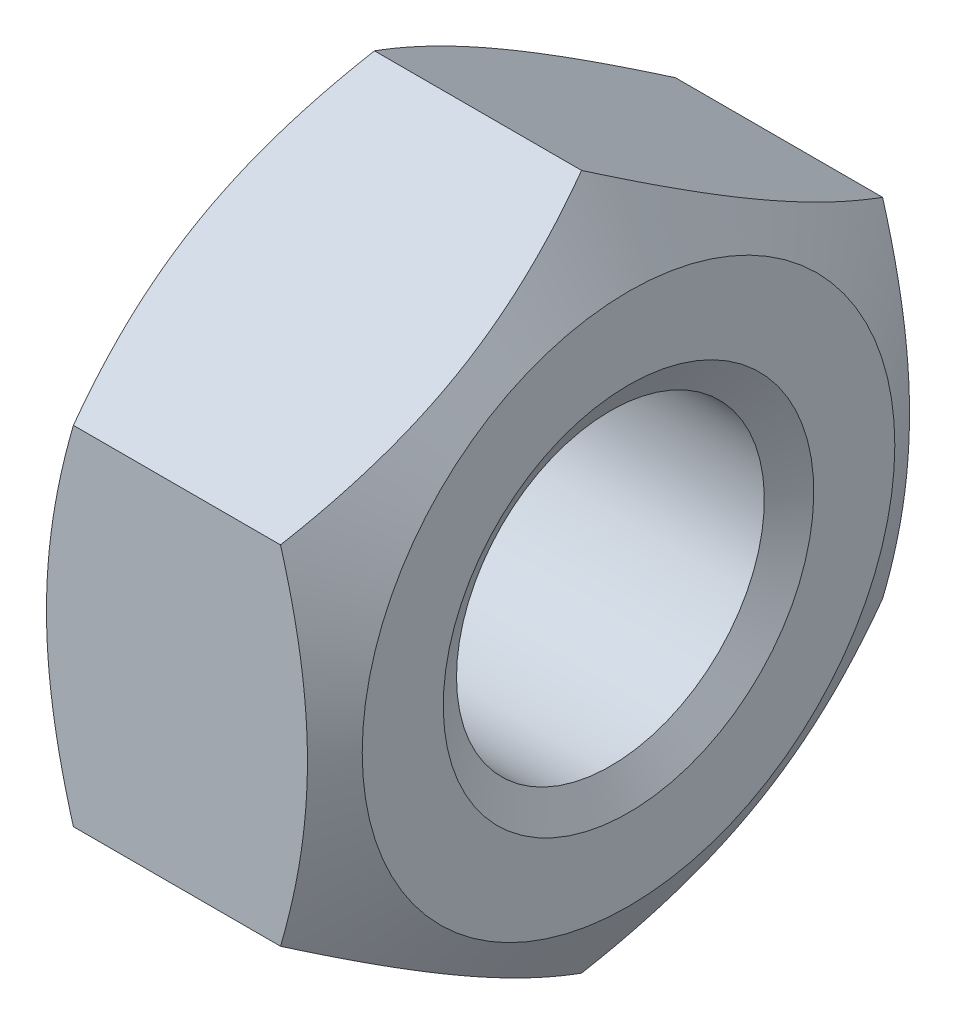
ISO-10303-21;
HEADER;
FILE_DESCRIPTION(('STEP AP214'),'2;1');
FILE_NAME('part.step','',(''),(''),'','','');
FILE_SCHEMA(('AUTOMOTIVE_DESIGN { 1 0 10303 214 1 1 1 1 }'));
ENDSEC;
DATA;
#1=APPLICATION_CONTEXT('core data for automotive mechanical design processes');
#2=APPLICATION_PROTOCOL_DEFINITION('international standard','automotive_design',2000,#1);
#3=PRODUCT_CONTEXT('',#1,'mechanical');
#4=PRODUCT('Part','Part','',(#3));
#5=PRODUCT_RELATED_PRODUCT_CATEGORY('part','',(#4));
#6=PRODUCT_DEFINITION_FORMATION('','',#4);
#7=PRODUCT_DEFINITION_CONTEXT('part definition',#1,'design');
#8=PRODUCT_DEFINITION('design','',#6,#7);
#9=PRODUCT_DEFINITION_SHAPE('','',#8);
#10=(LENGTH_UNIT() NAMED_UNIT(*) SI_UNIT(.MILLI.,.METRE.));
#11=(NAMED_UNIT(*) PLANE_ANGLE_UNIT() SI_UNIT($,.RADIAN.));
#12=(NAMED_UNIT(*) SI_UNIT($,.STERADIAN.) SOLID_ANGLE_UNIT());
#13=UNCERTAINTY_MEASURE_WITH_UNIT(LENGTH_MEASURE(1.E-05),#10,'distance_accuracy_value','');
#14=(GEOMETRIC_REPRESENTATION_CONTEXT(3) GLOBAL_UNCERTAINTY_ASSIGNED_CONTEXT((#13)) GLOBAL_UNIT_ASSIGNED_CONTEXT((#10,
#11,#12)) REPRESENTATION_CONTEXT('',''));
#15=CARTESIAN_POINT('',(0.,0.,0.));
#16=DIRECTION('',(0.,0.,1.));
#17=DIRECTION('',(1.,0.,0.));
#18=AXIS2_PLACEMENT_3D('',#15,#16,#17);
#19=CARTESIAN_POINT('',(0.1953125,0.,0.));
#20=DIRECTION('',(-1.,0.,0.));
#21=DIRECTION('',(0.,0.,1.));
#22=AXIS2_PLACEMENT_3D('',#19,#20,#21);
#23=CONICAL_SURFACE('',#22,3.6617911733533,1.0471975511966);
#24=CARTESIAN_POINT('',(0.390625,0.,0.));
#25=DIRECTION('',(1.,0.,0.));
#26=DIRECTION('',(0.,1.,0.));
#27=AXIS2_PLACEMENT_3D('',#24,#25,#26);
#28=CIRCLE('',#27,3.3235);
#29=CARTESIAN_POINT('',(0.390625,3.3235,0.));
#30=VERTEX_POINT('',#29);
#31=EDGE_CURVE('E10',#30,#30,#28,.T.);
#32=ORIENTED_EDGE('',*,*,#31,.T.);
#33=EDGE_LOOP('',(#32));
#34=FACE_BOUND('',#33,.T.);
#35=CARTESIAN_POINT('',(0.,0.,0.));
#36=DIRECTION('',(-1.,0.,0.));
#37=DIRECTION('',(0.,0.,1.));
#38=AXIS2_PLACEMENT_3D('',#35,#36,#37);
#39=CIRCLE('',#38,4.00008234670659);
#40=CARTESIAN_POINT('',(0.,0.,4.00008234670659));
#41=VERTEX_POINT('',#40);
#42=EDGE_CURVE('E26',#41,#41,#39,.T.);
#43=ORIENTED_EDGE('',*,*,#42,.T.);
#44=EDGE_LOOP('',(#43));
#45=FACE_BOUND('',#44,.T.);
#46=ADVANCED_FACE('F16',(#34,#45),#23,.F.);
#47=CARTESIAN_POINT('',(-14.4384017218762,0.,0.));
#48=DIRECTION('',(1.,0.,0.));
#49=DIRECTION('',(0.,1.,0.));
#50=AXIS2_PLACEMENT_3D('',#47,#48,#49);
#51=CYLINDRICAL_SURFACE('',#50,3.3235);
#52=CARTESIAN_POINT('',(6.109375,0.,0.));
#53=DIRECTION('',(-1.,0.,0.));
#54=DIRECTION('',(0.,0.,1.));
#55=AXIS2_PLACEMENT_3D('',#52,#53,#54);
#56=CIRCLE('',#55,3.3235);
#57=CARTESIAN_POINT('',(6.109375,0.,3.3235));
#58=VERTEX_POINT('',#57);
#59=EDGE_CURVE('E192',#58,#58,#56,.T.);
#60=ORIENTED_EDGE('',*,*,#59,.F.);
#61=EDGE_LOOP('',(#60));
#62=FACE_BOUND('',#61,.T.);
#63=ORIENTED_EDGE('',*,*,#31,.F.);
#64=EDGE_LOOP('',(#63));
#65=FACE_BOUND('',#64,.T.);
#66=ADVANCED_FACE('F205',(#62,#65),#51,.F.);
#67=CARTESIAN_POINT('',(0.,0.,0.));
#68=DIRECTION('',(1.,0.,0.));
#69=DIRECTION('',(0.,0.,-1.));
#70=AXIS2_PLACEMENT_3D('',#67,#68,#69);
#71=PLANE('',#70);
#72=CARTESIAN_POINT('',(0.,0.,0.));
#73=DIRECTION('',(-1.,0.,0.));
#74=DIRECTION('',(0.,0.,1.));
#75=AXIS2_PLACEMENT_3D('',#72,#73,#74);
#76=CIRCLE('',#75,5.75);
#77=CARTESIAN_POINT('',(0.,0.,5.75));
#78=VERTEX_POINT('',#77);
#79=EDGE_CURVE('E193',#78,#78,#76,.T.);
#80=ORIENTED_EDGE('',*,*,#79,.T.);
#81=EDGE_LOOP('',(#80));
#82=FACE_BOUND('',#81,.T.);
#83=ORIENTED_EDGE('',*,*,#42,.F.);
#84=EDGE_LOOP('',(#83));
#85=FACE_BOUND('',#84,.T.);
#86=ADVANCED_FACE('F202',(#82,#85),#71,.F.);
#87=CARTESIAN_POINT('',(6.3046875,0.,0.));
#88=DIRECTION('',(1.,0.,0.));
#89=DIRECTION('',(0.,1.,0.));
#90=AXIS2_PLACEMENT_3D('',#87,#88,#89);
#91=CONICAL_SURFACE('',#90,3.6617911733533,1.0471975511966);
#92=ORIENTED_EDGE('',*,*,#59,.T.);
#93=EDGE_LOOP('',(#92));
#94=FACE_BOUND('',#93,.T.);
#95=CARTESIAN_POINT('',(6.5,0.,0.));
#96=DIRECTION('',(1.,0.,0.));
#97=DIRECTION('',(0.,1.,0.));
#98=AXIS2_PLACEMENT_3D('',#95,#96,#97);
#99=CIRCLE('',#98,4.00008234670659);
#100=CARTESIAN_POINT('',(6.5,4.00008234670659,0.));
#101=VERTEX_POINT('',#100);
#102=EDGE_CURVE('E189',#101,#101,#99,.T.);
#103=ORIENTED_EDGE('',*,*,#102,.T.);
#104=EDGE_LOOP('',(#103));
#105=FACE_BOUND('',#104,.T.);
#106=ADVANCED_FACE('F204',(#94,#105),#91,.F.);
#107=CARTESIAN_POINT('',(6.5,0.,0.));
#108=DIRECTION('',(1.,0.,0.));
#109=DIRECTION('',(0.,0.,-1.));
#110=AXIS2_PLACEMENT_3D('',#107,#108,#109);
#111=PLANE('',#110);
#112=CARTESIAN_POINT('',(6.5,0.,0.));
#113=DIRECTION('',(1.,0.,0.));
#114=DIRECTION('',(0.,1.,0.));
#115=AXIS2_PLACEMENT_3D('',#112,#113,#114);
#116=CIRCLE('',#115,5.75);
#117=CARTESIAN_POINT('',(6.5,5.75,0.));
#118=VERTEX_POINT('',#117);
#119=EDGE_CURVE('E172',#118,#118,#116,.T.);
#120=ORIENTED_EDGE('',*,*,#119,.T.);
#121=EDGE_LOOP('',(#120));
#122=FACE_BOUND('',#121,.T.);
#123=ORIENTED_EDGE('',*,*,#102,.F.);
#124=EDGE_LOOP('',(#123));
#125=FACE_BOUND('',#124,.T.);
#126=ADVANCED_FACE('F213',(#122,#125),#111,.T.);
#127=CARTESIAN_POINT('',(0.506784642746492,0.,0.));
#128=DIRECTION('',(1.,0.,0.));
#129=DIRECTION('',(0.,0.,1.));
#130=AXIS2_PLACEMENT_3D('',#127,#128,#129);
#131=CONICAL_SURFACE('',#130,6.62777674973257,1.0471975511966);
#132=CARTESIAN_POINT('',(1.01356928549298,3.75277674973257,6.5));
#133=CARTESIAN_POINT('',(-0.0697640478403506,0.,6.5));
#134=CARTESIAN_POINT('',(1.01356928549298,-3.75277674973257,6.5));
#135=(BOUNDED_CURVE() B_SPLINE_CURVE(2,(#132,#133,#134),.UNSPECIFIED.,.F.,
.F.) B_SPLINE_CURVE_WITH_KNOTS((3,3),(0.,0.759483489750648),
.UNSPECIFIED.) CURVE() GEOMETRIC_REPRESENTATION_ITEM() RATIONAL_B_SPLINE_CURVE((1.,
1.15470053837925,1.)) REPRESENTATION_ITEM(''));
#136=CARTESIAN_POINT('',(1.01356928549298,3.75277674973257,6.5));
#137=VERTEX_POINT('',#136);
#138=CARTESIAN_POINT('',(1.01356928549298,-3.75277674973257,6.5));
#139=VERTEX_POINT('',#138);
#140=EDGE_CURVE('E35',#137,#139,#135,.T.);
#141=ORIENTED_EDGE('',*,*,#140,.F.);
#142=CARTESIAN_POINT('',(1.01356928549298,7.50555349946513,0.));
#143=CARTESIAN_POINT('',(-0.0697640478403495,5.62916512459885,3.25));
#144=CARTESIAN_POINT('',(1.01356928549298,3.75277674973256,6.50000000000001));
#145=(BOUNDED_CURVE() B_SPLINE_CURVE(2,(#142,#143,#144),.UNSPECIFIED.,.F.,
.F.) B_SPLINE_CURVE_WITH_KNOTS((3,3),(0.,0.759483489750648),
.UNSPECIFIED.) CURVE() GEOMETRIC_REPRESENTATION_ITEM() RATIONAL_B_SPLINE_CURVE((1.,
1.15470053837925,1.)) REPRESENTATION_ITEM(''));
#146=CARTESIAN_POINT('',(1.01356928549298,7.50555349946513,0.));
#147=VERTEX_POINT('',#146);
#148=EDGE_CURVE('E81',#147,#137,#145,.T.);
#149=ORIENTED_EDGE('',*,*,#148,.F.);
#150=CARTESIAN_POINT('',(1.01356928549298,3.75277674973259,-6.49999999999999));
#151=CARTESIAN_POINT('',(-0.0697640478403434,5.62916512459886,-3.24999999999999));
#152=CARTESIAN_POINT('',(1.01356928549298,7.50555349946513,0.));
#153=(BOUNDED_CURVE() B_SPLINE_CURVE(2,(#150,#151,#152),.UNSPECIFIED.,.F.,
.F.) B_SPLINE_CURVE_WITH_KNOTS((3,3),(0.,0.759483489750645),
.UNSPECIFIED.) CURVE() GEOMETRIC_REPRESENTATION_ITEM() RATIONAL_B_SPLINE_CURVE((1.,
1.15470053837925,1.)) REPRESENTATION_ITEM(''));
#154=CARTESIAN_POINT('',(1.01356928549298,3.75277674973259,-6.49999999999999));
#155=VERTEX_POINT('',#154);
#156=EDGE_CURVE('E165',#155,#147,#153,.T.);
#157=ORIENTED_EDGE('',*,*,#156,.F.);
#158=CARTESIAN_POINT('',(1.01356928549298,-3.75277674973254,-6.50000000000002));
#159=CARTESIAN_POINT('',(-0.0697640478403401,0.,-6.50000000000001));
#160=CARTESIAN_POINT('',(1.01356928549298,3.75277674973257,-6.5));
#161=(BOUNDED_CURVE() B_SPLINE_CURVE(2,(#158,#159,#160),.UNSPECIFIED.,.F.,
.F.) B_SPLINE_CURVE_WITH_KNOTS((3,3),(0.,0.759483489750644),
.UNSPECIFIED.) CURVE() GEOMETRIC_REPRESENTATION_ITEM() RATIONAL_B_SPLINE_CURVE((1.,
1.15470053837925,1.)) REPRESENTATION_ITEM(''));
#162=CARTESIAN_POINT('',(1.01356928549298,-3.75277674973254,-6.50000000000002));
#163=VERTEX_POINT('',#162);
#164=EDGE_CURVE('E89',#163,#155,#161,.T.);
#165=ORIENTED_EDGE('',*,*,#164,.F.);
#166=CARTESIAN_POINT('',(1.01356928549298,-7.50555349946514,0.));
#167=CARTESIAN_POINT('',(-0.0697640478403552,-5.62916512459884,-3.25));
#168=CARTESIAN_POINT('',(1.01356928549298,-3.75277674973255,-6.50000000000001));
#169=(BOUNDED_CURVE() B_SPLINE_CURVE(2,(#166,#167,#168),.UNSPECIFIED.,.F.,
.F.) B_SPLINE_CURVE_WITH_KNOTS((3,3),(0.,0.759483489750649),
.UNSPECIFIED.) CURVE() GEOMETRIC_REPRESENTATION_ITEM() RATIONAL_B_SPLINE_CURVE((1.,
1.15470053837925,1.)) REPRESENTATION_ITEM(''));
#170=CARTESIAN_POINT('',(1.01356928549298,-7.50555349946513,0.));
#171=VERTEX_POINT('',#170);
#172=EDGE_CURVE('E100',#171,#163,#169,.T.);
#173=ORIENTED_EDGE('',*,*,#172,.F.);
#174=CARTESIAN_POINT('',(1.01356928549298,-3.75277674973257,6.5));
#175=CARTESIAN_POINT('',(-0.0697640478403494,-5.62916512459885,3.25));
#176=CARTESIAN_POINT('',(1.01356928549298,-7.50555349946514,0.));
#177=(BOUNDED_CURVE() B_SPLINE_CURVE(2,(#174,#175,#176),.UNSPECIFIED.,.F.,
.F.) B_SPLINE_CURVE_WITH_KNOTS((3,3),(0.,0.759483489750648),
.UNSPECIFIED.) CURVE() GEOMETRIC_REPRESENTATION_ITEM() RATIONAL_B_SPLINE_CURVE((1.,
1.15470053837925,1.)) REPRESENTATION_ITEM(''));
#178=EDGE_CURVE('E133',#139,#171,#177,.T.);
#179=ORIENTED_EDGE('',*,*,#178,.F.);
#180=EDGE_LOOP('',(#141,#149,#157,#165,#173,#179));
#181=FACE_BOUND('',#180,.T.);
#182=ORIENTED_EDGE('',*,*,#79,.F.);
#183=EDGE_LOOP('',(#182));
#184=FACE_BOUND('',#183,.T.);
#185=ADVANCED_FACE('F18',(#181,#184),#131,.T.);
#186=CARTESIAN_POINT('',(5.99321535725351,0.,0.));
#187=DIRECTION('',(-1.,0.,0.));
#188=DIRECTION('',(0.,0.,1.));
#189=AXIS2_PLACEMENT_3D('',#186,#187,#188);
#190=CONICAL_SURFACE('',#189,6.62777674973257,1.0471975511966);
#191=CARTESIAN_POINT('',(5.48643071450702,3.75277674973256,6.50000000000001));
#192=CARTESIAN_POINT('',(6.56976404784035,5.62916512459885,3.25));
#193=CARTESIAN_POINT('',(5.48643071450702,7.50555349946513,0.));
#194=(BOUNDED_CURVE() B_SPLINE_CURVE(2,(#191,#192,#193),.UNSPECIFIED.,.F.,
.F.) B_SPLINE_CURVE_WITH_KNOTS((3,3),(0.,0.759483489750648),
.UNSPECIFIED.) CURVE() GEOMETRIC_REPRESENTATION_ITEM() RATIONAL_B_SPLINE_CURVE((1.,
1.15470053837925,1.)) REPRESENTATION_ITEM(''));
#195=CARTESIAN_POINT('',(5.48643071450702,3.75277674973257,6.5));
#196=VERTEX_POINT('',#195);
#197=CARTESIAN_POINT('',(5.48643071450702,7.50555349946513,0.));
#198=VERTEX_POINT('',#197);
#199=EDGE_CURVE('E103',#196,#198,#194,.T.);
#200=ORIENTED_EDGE('',*,*,#199,.F.);
#201=CARTESIAN_POINT('',(5.48643071450702,-3.75277674973258,6.5));
#202=CARTESIAN_POINT('',(6.56976404784035,0.,6.5));
#203=CARTESIAN_POINT('',(5.48643071450702,3.75277674973258,6.5));
#204=(BOUNDED_CURVE() B_SPLINE_CURVE(2,(#201,#202,#203),.UNSPECIFIED.,.F.,
.F.) B_SPLINE_CURVE_WITH_KNOTS((3,3),(0.,0.759483489750648),
.UNSPECIFIED.) CURVE() GEOMETRIC_REPRESENTATION_ITEM() RATIONAL_B_SPLINE_CURVE((1.,
1.15470053837925,1.)) REPRESENTATION_ITEM(''));
#205=CARTESIAN_POINT('',(5.48643071450702,-3.75277674973257,6.5));
#206=VERTEX_POINT('',#205);
#207=EDGE_CURVE('E106',#206,#196,#204,.T.);
#208=ORIENTED_EDGE('',*,*,#207,.F.);
#209=CARTESIAN_POINT('',(5.48643071450702,-7.50555349946513,0.));
#210=CARTESIAN_POINT('',(6.56976404784035,-5.62916512459885,3.25));
#211=CARTESIAN_POINT('',(5.48643071450702,-3.75277674973257,6.5));
#212=(BOUNDED_CURVE() B_SPLINE_CURVE(2,(#209,#210,#211),.UNSPECIFIED.,.F.,
.F.) B_SPLINE_CURVE_WITH_KNOTS((3,3),(0.,0.759483489750647),
.UNSPECIFIED.) CURVE() GEOMETRIC_REPRESENTATION_ITEM() RATIONAL_B_SPLINE_CURVE((1.,
1.15470053837925,1.)) REPRESENTATION_ITEM(''));
#213=CARTESIAN_POINT('',(5.48643071450702,-7.50555349946513,0.));
#214=VERTEX_POINT('',#213);
#215=EDGE_CURVE('E121',#214,#206,#212,.T.);
#216=ORIENTED_EDGE('',*,*,#215,.F.);
#217=CARTESIAN_POINT('',(5.48643071450702,-3.75277674973255,-6.50000000000001));
#218=CARTESIAN_POINT('',(6.56976404784036,-5.62916512459885,-3.25));
#219=CARTESIAN_POINT('',(5.48643071450702,-7.50555349946514,0.));
#220=(BOUNDED_CURVE() B_SPLINE_CURVE(2,(#217,#218,#219),.UNSPECIFIED.,.F.,
.F.) B_SPLINE_CURVE_WITH_KNOTS((3,3),(0.,0.759483489750649),
.UNSPECIFIED.) CURVE() GEOMETRIC_REPRESENTATION_ITEM() RATIONAL_B_SPLINE_CURVE((1.,
1.15470053837925,1.)) REPRESENTATION_ITEM(''));
#221=CARTESIAN_POINT('',(5.48643071450702,-3.75277674973254,-6.50000000000002));
#222=VERTEX_POINT('',#221);
#223=EDGE_CURVE('E66',#222,#214,#220,.T.);
#224=ORIENTED_EDGE('',*,*,#223,.F.);
#225=CARTESIAN_POINT('',(5.48643071450702,3.75277674973257,-6.5));
#226=CARTESIAN_POINT('',(6.56976404784034,0.,-6.50000000000001));
#227=CARTESIAN_POINT('',(5.48643071450702,-3.75277674973254,-6.50000000000002));
#228=(BOUNDED_CURVE() B_SPLINE_CURVE(2,(#225,#226,#227),.UNSPECIFIED.,.F.,
.F.) B_SPLINE_CURVE_WITH_KNOTS((3,3),(0.,0.759483489750645),
.UNSPECIFIED.) CURVE() GEOMETRIC_REPRESENTATION_ITEM() RATIONAL_B_SPLINE_CURVE((1.,
1.15470053837925,1.)) REPRESENTATION_ITEM(''));
#229=CARTESIAN_POINT('',(5.48643071450702,3.75277674973259,-6.49999999999999));
#230=VERTEX_POINT('',#229);
#231=EDGE_CURVE('E69',#230,#222,#228,.T.);
#232=ORIENTED_EDGE('',*,*,#231,.F.);
#233=CARTESIAN_POINT('',(5.48643071450702,7.50555349946513,0.));
#234=CARTESIAN_POINT('',(6.56976404784035,5.62916512459886,-3.24999999999999));
#235=CARTESIAN_POINT('',(5.48643071450702,3.75277674973259,-6.49999999999999));
#236=(BOUNDED_CURVE() B_SPLINE_CURVE(2,(#233,#234,#235),.UNSPECIFIED.,.F.,
.F.) B_SPLINE_CURVE_WITH_KNOTS((3,3),(0.,0.759483489750645),
.UNSPECIFIED.) CURVE() GEOMETRIC_REPRESENTATION_ITEM() RATIONAL_B_SPLINE_CURVE((1.,
1.15470053837925,1.)) REPRESENTATION_ITEM(''));
#237=EDGE_CURVE('E74',#198,#230,#236,.T.);
#238=ORIENTED_EDGE('',*,*,#237,.F.);
#239=EDGE_LOOP('',(#200,#208,#216,#224,#232,#238));
#240=FACE_BOUND('',#239,.T.);
#241=ORIENTED_EDGE('',*,*,#119,.F.);
#242=EDGE_LOOP('',(#241));
#243=FACE_BOUND('',#242,.T.);
#244=ADVANCED_FACE('F72',(#240,#243),#190,.T.);
#245=CARTESIAN_POINT('',(0.,7.50555349946513,0.));
#246=DIRECTION('',(0.,0.866025403784439,-0.499999999999999));
#247=DIRECTION('',(0.,0.499999999999999,0.866025403784439));
#248=AXIS2_PLACEMENT_3D('',#245,#246,#247);
#249=PLANE('',#248);
#250=ORIENTED_EDGE('',*,*,#156,.T.);
#251=DIRECTION('',(1.,0.,0.));
#252=VECTOR('',#251,1.);
#253=CARTESIAN_POINT('',(0.,7.50555349946513,0.));
#254=LINE('',#253,#252);
#255=EDGE_CURVE('E88',#147,#198,#254,.T.);
#256=ORIENTED_EDGE('',*,*,#255,.T.);
#257=ORIENTED_EDGE('',*,*,#237,.T.);
#258=DIRECTION('',(1.,0.,0.));
#259=VECTOR('',#258,1.);
#260=CARTESIAN_POINT('',(0.,3.75277674973258,-6.5));
#261=LINE('',#260,#259);
#262=EDGE_CURVE('E80',#155,#230,#261,.T.);
#263=ORIENTED_EDGE('',*,*,#262,.F.);
#264=EDGE_LOOP('',(#250,#256,#257,#263));
#265=FACE_BOUND('',#264,.T.);
#266=ADVANCED_FACE('F86',(#265),#249,.T.);
#267=CARTESIAN_POINT('',(0.,3.75277674973258,-6.5));
#268=DIRECTION('',(0.,0.,-1.));
#269=DIRECTION('',(0.,1.,0.));
#270=AXIS2_PLACEMENT_3D('',#267,#268,#269);
#271=PLANE('',#270);
#272=ORIENTED_EDGE('',*,*,#164,.T.);
#273=ORIENTED_EDGE('',*,*,#262,.T.);
#274=ORIENTED_EDGE('',*,*,#231,.T.);
#275=DIRECTION('',(1.,0.,0.));
#276=VECTOR('',#275,1.);
#277=CARTESIAN_POINT('',(0.,-3.75277674973255,-6.50000000000002));
#278=LINE('',#277,#276);
#279=EDGE_CURVE('E98',#163,#222,#278,.T.);
#280=ORIENTED_EDGE('',*,*,#279,.F.);
#281=EDGE_LOOP('',(#272,#273,#274,#280));
#282=FACE_BOUND('',#281,.T.);
#283=ADVANCED_FACE('F91',(#282),#271,.T.);
#284=CARTESIAN_POINT('',(0.,3.75277674973257,6.5));
#285=DIRECTION('',(0.,0.866025403784438,0.500000000000001));
#286=DIRECTION('',(0.,-0.500000000000001,0.866025403784438));
#287=AXIS2_PLACEMENT_3D('',#284,#285,#286);
#288=PLANE('',#287);
#289=ORIENTED_EDGE('',*,*,#148,.T.);
#290=DIRECTION('',(1.,0.,0.));
#291=VECTOR('',#290,1.);
#292=CARTESIAN_POINT('',(0.,3.75277674973257,6.5));
#293=LINE('',#292,#291);
#294=EDGE_CURVE('E101',#137,#196,#293,.T.);
#295=ORIENTED_EDGE('',*,*,#294,.T.);
#296=ORIENTED_EDGE('',*,*,#199,.T.);
#297=ORIENTED_EDGE('',*,*,#255,.F.);
#298=EDGE_LOOP('',(#289,#295,#296,#297));
#299=FACE_BOUND('',#298,.T.);
#300=ADVANCED_FACE('F245',(#299),#288,.T.);
#301=CARTESIAN_POINT('',(0.,-3.75277674973257,6.5));
#302=DIRECTION('',(0.,0.,1.));
#303=DIRECTION('',(1.,0.,0.));
#304=AXIS2_PLACEMENT_3D('',#301,#302,#303);
#305=PLANE('',#304);
#306=ORIENTED_EDGE('',*,*,#140,.T.);
#307=DIRECTION('',(1.,0.,0.));
#308=VECTOR('',#307,1.);
#309=CARTESIAN_POINT('',(0.,-3.75277674973257,6.5));
#310=LINE('',#309,#308);
#311=EDGE_CURVE('E104',#139,#206,#310,.T.);
#312=ORIENTED_EDGE('',*,*,#311,.T.);
#313=ORIENTED_EDGE('',*,*,#207,.T.);
#314=ORIENTED_EDGE('',*,*,#294,.F.);
#315=EDGE_LOOP('',(#306,#312,#313,#314));
#316=FACE_BOUND('',#315,.T.);
#317=ADVANCED_FACE('F248',(#316),#305,.T.);
#318=CARTESIAN_POINT('',(0.,-3.75277674973255,-6.50000000000002));
#319=DIRECTION('',(0.,-0.866025403784438,-0.500000000000001));
#320=DIRECTION('',(0.,0.500000000000001,-0.866025403784438));
#321=AXIS2_PLACEMENT_3D('',#318,#319,#320);
#322=PLANE('',#321);
#323=ORIENTED_EDGE('',*,*,#172,.T.);
#324=ORIENTED_EDGE('',*,*,#279,.T.);
#325=ORIENTED_EDGE('',*,*,#223,.T.);
#326=DIRECTION('',(1.,0.,0.));
#327=VECTOR('',#326,1.);
#328=CARTESIAN_POINT('',(0.,-7.50555349946513,0.));
#329=LINE('',#328,#327);
#330=EDGE_CURVE('E20',#171,#214,#329,.T.);
#331=ORIENTED_EDGE('',*,*,#330,.F.);
#332=EDGE_LOOP('',(#323,#324,#325,#331));
#333=FACE_BOUND('',#332,.T.);
#334=ADVANCED_FACE('F251',(#333),#322,.T.);
#335=CARTESIAN_POINT('',(0.,-7.50555349946513,0.));
#336=DIRECTION('',(0.,-0.866025403784439,0.5));
#337=DIRECTION('',(0.,-0.5,-0.866025403784439));
#338=AXIS2_PLACEMENT_3D('',#335,#336,#337);
#339=PLANE('',#338);
#340=ORIENTED_EDGE('',*,*,#178,.T.);
#341=ORIENTED_EDGE('',*,*,#330,.T.);
#342=ORIENTED_EDGE('',*,*,#215,.T.);
#343=ORIENTED_EDGE('',*,*,#311,.F.);
#344=EDGE_LOOP('',(#340,#341,#342,#343));
#345=FACE_BOUND('',#344,.T.);
#346=ADVANCED_FACE('F225',(#345),#339,.T.);
#347=CLOSED_SHELL('',(#46,#66,#86,#106,#126,#185,#244,#266,#283,#300,#317,#334,#346));
#348=MANIFOLD_SOLID_BREP('B1',#347);
#349=ADVANCED_BREP_SHAPE_REPRESENTATION('',(#18,#348),#14);
#350=SHAPE_DEFINITION_REPRESENTATION(#9,#349);
ENDSEC;
END-ISO-10303-21;
